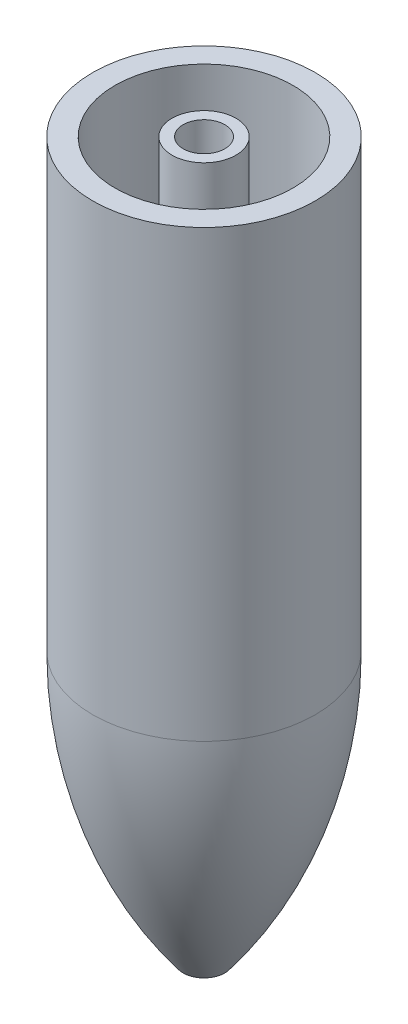
ISO-10303-21;
HEADER;
FILE_DESCRIPTION(('STEP AP214'),'2;1');
FILE_NAME('part.step','',(''),(''),'','','');
FILE_SCHEMA(('AUTOMOTIVE_DESIGN { 1 0 10303 214 1 1 1 1 }'));
ENDSEC;
DATA;
#1=APPLICATION_CONTEXT('core data for automotive mechanical design processes');
#2=APPLICATION_PROTOCOL_DEFINITION('international standard','automotive_design',2000,#1);
#3=PRODUCT_CONTEXT('',#1,'mechanical');
#4=PRODUCT('Part','Part','',(#3));
#5=PRODUCT_RELATED_PRODUCT_CATEGORY('part','',(#4));
#6=PRODUCT_DEFINITION_FORMATION('','',#4);
#7=PRODUCT_DEFINITION_CONTEXT('part definition',#1,'design');
#8=PRODUCT_DEFINITION('design','',#6,#7);
#9=PRODUCT_DEFINITION_SHAPE('','',#8);
#10=(LENGTH_UNIT() NAMED_UNIT(*) SI_UNIT(.MILLI.,.METRE.));
#11=(NAMED_UNIT(*) PLANE_ANGLE_UNIT() SI_UNIT($,.RADIAN.));
#12=(NAMED_UNIT(*) SI_UNIT($,.STERADIAN.) SOLID_ANGLE_UNIT());
#13=UNCERTAINTY_MEASURE_WITH_UNIT(LENGTH_MEASURE(1.E-05),#10,'distance_accuracy_value','');
#14=(GEOMETRIC_REPRESENTATION_CONTEXT(3) GLOBAL_UNCERTAINTY_ASSIGNED_CONTEXT((#13)) GLOBAL_UNIT_ASSIGNED_CONTEXT((#10,
#11,#12)) REPRESENTATION_CONTEXT('',''));
#15=CARTESIAN_POINT('',(0.,0.,0.));
#16=DIRECTION('',(0.,0.,1.));
#17=DIRECTION('',(1.,0.,0.));
#18=AXIS2_PLACEMENT_3D('',#15,#16,#17);
#19=CARTESIAN_POINT('',(12.7,0.,0.));
#20=DIRECTION('',(0.,-1.,0.));
#21=DIRECTION('',(1.,0.,0.));
#22=AXIS2_PLACEMENT_3D('',#19,#20,#21);
#23=PLANE('',#22);
#24=CARTESIAN_POINT('',(12.7,0.,0.));
#25=DIRECTION('',(0.,1.,0.));
#26=DIRECTION('',(-1.,0.,0.));
#27=AXIS2_PLACEMENT_3D('',#24,#25,#26);
#28=CIRCLE('',#27,2.38125);
#29=CARTESIAN_POINT('',(10.31875,0.,0.));
#30=VERTEX_POINT('',#29);
#31=EDGE_CURVE('E52',#30,#30,#28,.T.);
#32=ORIENTED_EDGE('',*,*,#31,.F.);
#33=EDGE_LOOP('',(#32));
#34=FACE_BOUND('',#33,.T.);
#35=CARTESIAN_POINT('',(12.7,0.,0.));
#36=DIRECTION('',(0.,1.,0.));
#37=DIRECTION('',(-1.,0.,0.));
#38=AXIS2_PLACEMENT_3D('',#35,#36,#37);
#39=CIRCLE('',#38,3.65125);
#40=CARTESIAN_POINT('',(9.04875000000001,0.,0.));
#41=VERTEX_POINT('',#40);
#42=EDGE_CURVE('E62',#41,#41,#39,.T.);
#43=ORIENTED_EDGE('',*,*,#42,.T.);
#44=EDGE_LOOP('',(#43));
#45=FACE_BOUND('',#44,.T.);
#46=ADVANCED_FACE('F36',(#34,#45),#23,.F.);
#47=CARTESIAN_POINT('',(12.7,0.,0.));
#48=DIRECTION('',(0.,1.,0.));
#49=DIRECTION('',(-1.,0.,0.));
#50=AXIS2_PLACEMENT_3D('',#47,#48,#49);
#51=CIRCLE('',#50,10.16);
#52=CARTESIAN_POINT('',(2.54,0.,0.));
#53=VERTEX_POINT('',#52);
#54=EDGE_CURVE('E57',#53,#53,#51,.T.);
#55=ORIENTED_EDGE('',*,*,#54,.F.);
#56=EDGE_LOOP('',(#55));
#57=FACE_BOUND('',#56,.T.);
#58=CARTESIAN_POINT('',(12.7,0.,0.));
#59=DIRECTION('',(0.,-1.,0.));
#60=DIRECTION('',(1.,0.,0.));
#61=AXIS2_PLACEMENT_3D('',#58,#59,#60);
#62=CIRCLE('',#61,12.7);
#63=CARTESIAN_POINT('',(25.4,0.,0.));
#64=VERTEX_POINT('',#63);
#65=EDGE_CURVE('E10',#64,#64,#62,.T.);
#66=ORIENTED_EDGE('',*,*,#65,.F.);
#67=EDGE_LOOP('',(#66));
#68=FACE_BOUND('',#67,.T.);
#69=ADVANCED_FACE('F38',(#57,#68),#23,.F.);
#70=CARTESIAN_POINT('',(12.7,-84.4010416505203,0.));
#71=DIRECTION('',(0.,-1.,0.));
#72=DIRECTION('',(1.,0.,0.));
#73=AXIS2_PLACEMENT_3D('',#70,#71,#72);
#74=CYLINDRICAL_SURFACE('',#73,12.7);
#75=CARTESIAN_POINT('',(12.7,-50.8,0.));
#76=DIRECTION('',(0.,-1.,0.));
#77=DIRECTION('',(1.,0.,0.));
#78=AXIS2_PLACEMENT_3D('',#75,#76,#77);
#79=CIRCLE('',#78,12.7);
#80=CARTESIAN_POINT('',(25.4,-50.8,0.));
#81=VERTEX_POINT('',#80);
#82=EDGE_CURVE('E45',#81,#81,#79,.T.);
#83=ORIENTED_EDGE('',*,*,#82,.F.);
#84=EDGE_LOOP('',(#83));
#85=FACE_BOUND('',#84,.T.);
#86=ORIENTED_EDGE('',*,*,#65,.T.);
#87=EDGE_LOOP('',(#86));
#88=FACE_BOUND('',#87,.T.);
#89=ADVANCED_FACE('F90',(#85,#88),#74,.T.);
#90=CARTESIAN_POINT('',(12.7,-50.8,0.));
#91=DIRECTION('',(0.,-1.,0.));
#92=DIRECTION('',(1.,0.,0.));
#93=AXIS2_PLACEMENT_3D('',#90,#91,#92);
#94=DEGENERATE_TOROIDAL_SURFACE('',#93,38.1,50.8,.F.);
#95=CARTESIAN_POINT('',(12.7,-81.4905262000752,0.));
#96=DIRECTION('',(0.,1.,0.));
#97=DIRECTION('',(-1.,0.,0.));
#98=AXIS2_PLACEMENT_3D('',#95,#96,#97);
#99=CIRCLE('',#98,2.38125);
#100=CARTESIAN_POINT('',(10.31875,-81.4905262000752,0.));
#101=VERTEX_POINT('',#100);
#102=EDGE_CURVE('E40',#101,#101,#99,.T.);
#103=ORIENTED_EDGE('',*,*,#102,.T.);
#104=EDGE_LOOP('',(#103));
#105=FACE_BOUND('',#104,.T.);
#106=ORIENTED_EDGE('',*,*,#82,.T.);
#107=EDGE_LOOP('',(#106));
#108=FACE_BOUND('',#107,.T.);
#109=ADVANCED_FACE('F95',(#105,#108),#94,.F.);
#110=CARTESIAN_POINT('',(12.7,-84.4010416505203,0.));
#111=DIRECTION('',(0.,1.,0.));
#112=DIRECTION('',(-1.,0.,0.));
#113=AXIS2_PLACEMENT_3D('',#110,#111,#112);
#114=CYLINDRICAL_SURFACE('',#113,2.38125);
#115=ORIENTED_EDGE('',*,*,#31,.T.);
#116=EDGE_LOOP('',(#115));
#117=FACE_BOUND('',#116,.T.);
#118=ORIENTED_EDGE('',*,*,#102,.F.);
#119=EDGE_LOOP('',(#118));
#120=FACE_BOUND('',#119,.T.);
#121=ADVANCED_FACE('F104',(#117,#120),#114,.F.);
#122=CARTESIAN_POINT('',(12.7,-50.8,0.));
#123=DIRECTION('',(0.,1.,0.));
#124=DIRECTION('',(-1.,0.,0.));
#125=AXIS2_PLACEMENT_3D('',#122,#123,#124);
#126=CYLINDRICAL_SURFACE('',#125,3.65125);
#127=CARTESIAN_POINT('',(12.7,-50.8,0.));
#128=DIRECTION('',(0.,1.,0.));
#129=DIRECTION('',(-1.,0.,0.));
#130=AXIS2_PLACEMENT_3D('',#127,#128,#129);
#131=CIRCLE('',#130,3.65125);
#132=CARTESIAN_POINT('',(9.04875000000002,-50.8,0.));
#133=VERTEX_POINT('',#132);
#134=EDGE_CURVE('E61',#133,#133,#131,.T.);
#135=ORIENTED_EDGE('',*,*,#134,.T.);
#136=EDGE_LOOP('',(#135));
#137=FACE_BOUND('',#136,.T.);
#138=ORIENTED_EDGE('',*,*,#42,.F.);
#139=EDGE_LOOP('',(#138));
#140=FACE_BOUND('',#139,.T.);
#141=ADVANCED_FACE('F73',(#137,#140),#126,.T.);
#142=CARTESIAN_POINT('',(12.7,-50.8,0.));
#143=DIRECTION('',(0.,1.,0.));
#144=DIRECTION('',(-1.,0.,0.));
#145=AXIS2_PLACEMENT_3D('',#142,#143,#144);
#146=CYLINDRICAL_SURFACE('',#145,10.16);
#147=CARTESIAN_POINT('',(12.7,-50.8,0.));
#148=DIRECTION('',(0.,1.,0.));
#149=DIRECTION('',(-1.,0.,0.));
#150=AXIS2_PLACEMENT_3D('',#147,#148,#149);
#151=CIRCLE('',#150,10.16);
#152=CARTESIAN_POINT('',(2.54000000000001,-50.8,0.));
#153=VERTEX_POINT('',#152);
#154=EDGE_CURVE('E56',#153,#153,#151,.T.);
#155=ORIENTED_EDGE('',*,*,#154,.F.);
#156=EDGE_LOOP('',(#155));
#157=FACE_BOUND('',#156,.T.);
#158=ORIENTED_EDGE('',*,*,#54,.T.);
#159=EDGE_LOOP('',(#158));
#160=FACE_BOUND('',#159,.T.);
#161=ADVANCED_FACE('F79',(#157,#160),#146,.F.);
#162=CARTESIAN_POINT('',(0.,-50.8,0.));
#163=DIRECTION('',(0.,1.,0.));
#164=DIRECTION('',(-1.,0.,0.));
#165=AXIS2_PLACEMENT_3D('',#162,#163,#164);
#166=PLANE('',#165);
#167=ORIENTED_EDGE('',*,*,#134,.F.);
#168=EDGE_LOOP('',(#167));
#169=FACE_BOUND('',#168,.T.);
#170=ORIENTED_EDGE('',*,*,#154,.T.);
#171=EDGE_LOOP('',(#170));
#172=FACE_BOUND('',#171,.T.);
#173=ADVANCED_FACE('F76',(#169,#172),#166,.T.);
#174=CLOSED_SHELL('',(#46,#69,#89,#109,#121,#141,#161,#173));
#175=MANIFOLD_SOLID_BREP('B2',#174);
#176=ADVANCED_BREP_SHAPE_REPRESENTATION('',(#18,#175),#14);
#177=SHAPE_DEFINITION_REPRESENTATION(#9,#176);
ENDSEC;
END-ISO-10303-21;
